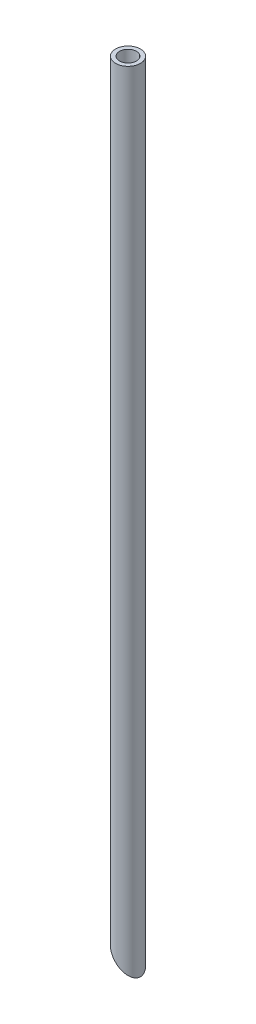
ISO-10303-21;
HEADER;
FILE_DESCRIPTION(('STEP AP214'),'2;1');
FILE_NAME('part.step','',(''),(''),'','','');
FILE_SCHEMA(('AUTOMOTIVE_DESIGN { 1 0 10303 214 1 1 1 1 }'));
ENDSEC;
DATA;
#1=APPLICATION_CONTEXT('core data for automotive mechanical design processes');
#2=APPLICATION_PROTOCOL_DEFINITION('international standard','automotive_design',2000,#1);
#3=PRODUCT_CONTEXT('',#1,'mechanical');
#4=PRODUCT('Part','Part','',(#3));
#5=PRODUCT_RELATED_PRODUCT_CATEGORY('part','',(#4));
#6=PRODUCT_DEFINITION_FORMATION('','',#4);
#7=PRODUCT_DEFINITION_CONTEXT('part definition',#1,'design');
#8=PRODUCT_DEFINITION('design','',#6,#7);
#9=PRODUCT_DEFINITION_SHAPE('','',#8);
#10=(LENGTH_UNIT() NAMED_UNIT(*) SI_UNIT(.MILLI.,.METRE.));
#11=(NAMED_UNIT(*) PLANE_ANGLE_UNIT() SI_UNIT($,.RADIAN.));
#12=(NAMED_UNIT(*) SI_UNIT($,.STERADIAN.) SOLID_ANGLE_UNIT());
#13=UNCERTAINTY_MEASURE_WITH_UNIT(LENGTH_MEASURE(1.E-05),#10,'distance_accuracy_value','');
#14=(GEOMETRIC_REPRESENTATION_CONTEXT(3) GLOBAL_UNCERTAINTY_ASSIGNED_CONTEXT((#13)) GLOBAL_UNIT_ASSIGNED_CONTEXT((#10,
#11,#12)) REPRESENTATION_CONTEXT('',''));
#15=CARTESIAN_POINT('',(0.,0.,0.));
#16=DIRECTION('',(0.,0.,1.));
#17=DIRECTION('',(1.,0.,0.));
#18=AXIS2_PLACEMENT_3D('',#15,#16,#17);
#19=CARTESIAN_POINT('',(0.,15.,0.));
#20=DIRECTION('',(0.,1.,0.));
#21=DIRECTION('',(0.,0.,1.));
#22=AXIS2_PLACEMENT_3D('',#19,#20,#21);
#23=PLANE('',#22);
#24=CARTESIAN_POINT('',(0.,15.,0.));
#25=DIRECTION('',(0.,1.,0.));
#26=DIRECTION('',(0.,0.,1.));
#27=AXIS2_PLACEMENT_3D('',#24,#25,#26);
#28=CIRCLE('',#27,0.23622);
#29=CARTESIAN_POINT('',(0.,15.,0.23622));
#30=VERTEX_POINT('',#29);
#31=EDGE_CURVE('E10',#30,#30,#28,.T.);
#32=ORIENTED_EDGE('',*,*,#31,.T.);
#33=EDGE_LOOP('',(#32));
#34=FACE_BOUND('',#33,.T.);
#35=CARTESIAN_POINT('',(0.,15.,0.));
#36=DIRECTION('',(0.,1.,0.));
#37=DIRECTION('',(0.,0.,1.));
#38=AXIS2_PLACEMENT_3D('',#35,#36,#37);
#39=CIRCLE('',#38,0.16002);
#40=CARTESIAN_POINT('',(0.,15.,0.16002));
#41=VERTEX_POINT('',#40);
#42=EDGE_CURVE('E52',#41,#41,#39,.T.);
#43=ORIENTED_EDGE('',*,*,#42,.F.);
#44=EDGE_LOOP('',(#43));
#45=FACE_BOUND('',#44,.T.);
#46=ADVANCED_FACE('F43',(#34,#45),#23,.T.);
#47=CARTESIAN_POINT('',(0.,15.,0.));
#48=DIRECTION('',(0.,-1.,0.));
#49=DIRECTION('',(0.,0.,-1.));
#50=AXIS2_PLACEMENT_3D('',#47,#48,#49);
#51=CYLINDRICAL_SURFACE('',#50,0.23622);
#52=ORIENTED_EDGE('',*,*,#31,.F.);
#53=EDGE_LOOP('',(#52));
#54=FACE_BOUND('',#53,.T.);
#55=CARTESIAN_POINT('',(0.,0.236219999999997,0.));
#56=DIRECTION('',(0.707106781186544,0.707106781186551,0.));
#57=DIRECTION('',(0.707106781186551,-0.707106781186544,0.));
#58=AXIS2_PLACEMENT_3D('',#55,#56,#57);
#59=ELLIPSE('',#58,0.334065527703771,0.23622);
#60=CARTESIAN_POINT('',(0.23622,0.,0.));
#61=VERTEX_POINT('',#60);
#62=EDGE_CURVE('E57',#61,#61,#59,.T.);
#63=ORIENTED_EDGE('',*,*,#62,.T.);
#64=EDGE_LOOP('',(#63));
#65=FACE_BOUND('',#64,.T.);
#66=ADVANCED_FACE('F45',(#54,#65),#51,.T.);
#67=CARTESIAN_POINT('',(0.,15.,0.));
#68=DIRECTION('',(0.,-1.,0.));
#69=DIRECTION('',(0.,0.,-1.));
#70=AXIS2_PLACEMENT_3D('',#67,#68,#69);
#71=CYLINDRICAL_SURFACE('',#70,0.16002);
#72=CARTESIAN_POINT('',(0.,0.236219999999997,0.));
#73=DIRECTION('',(0.707106781186544,0.707106781186551,0.));
#74=DIRECTION('',(0.707106781186551,-0.707106781186544,0.));
#75=AXIS2_PLACEMENT_3D('',#72,#73,#74);
#76=ELLIPSE('',#75,0.226302454250942,0.16002);
#77=CARTESIAN_POINT('',(0.16002,0.0761999999999985,0.));
#78=VERTEX_POINT('',#77);
#79=EDGE_CURVE('E47',#78,#78,#76,.T.);
#80=ORIENTED_EDGE('',*,*,#79,.F.);
#81=EDGE_LOOP('',(#80));
#82=FACE_BOUND('',#81,.T.);
#83=ORIENTED_EDGE('',*,*,#42,.T.);
#84=EDGE_LOOP('',(#83));
#85=FACE_BOUND('',#84,.T.);
#86=ADVANCED_FACE('F71',(#82,#85),#71,.F.);
#87=CARTESIAN_POINT('',(0.23622,0.,-0.23622));
#88=DIRECTION('',(0.707106781186544,0.707106781186551,0.));
#89=DIRECTION('',(-0.707106781186551,0.707106781186544,0.));
#90=AXIS2_PLACEMENT_3D('',#87,#88,#89);
#91=PLANE('',#90);
#92=ORIENTED_EDGE('',*,*,#79,.T.);
#93=EDGE_LOOP('',(#92));
#94=FACE_BOUND('',#93,.T.);
#95=ORIENTED_EDGE('',*,*,#62,.F.);
#96=EDGE_LOOP('',(#95));
#97=FACE_BOUND('',#96,.T.);
#98=ADVANCED_FACE('F68',(#94,#97),#91,.F.);
#99=CLOSED_SHELL('',(#46,#66,#86,#98));
#100=MANIFOLD_SOLID_BREP('B2',#99);
#101=ADVANCED_BREP_SHAPE_REPRESENTATION('',(#18,#100),#14);
#102=SHAPE_DEFINITION_REPRESENTATION(#9,#101);
ENDSEC;
END-ISO-10303-21;
